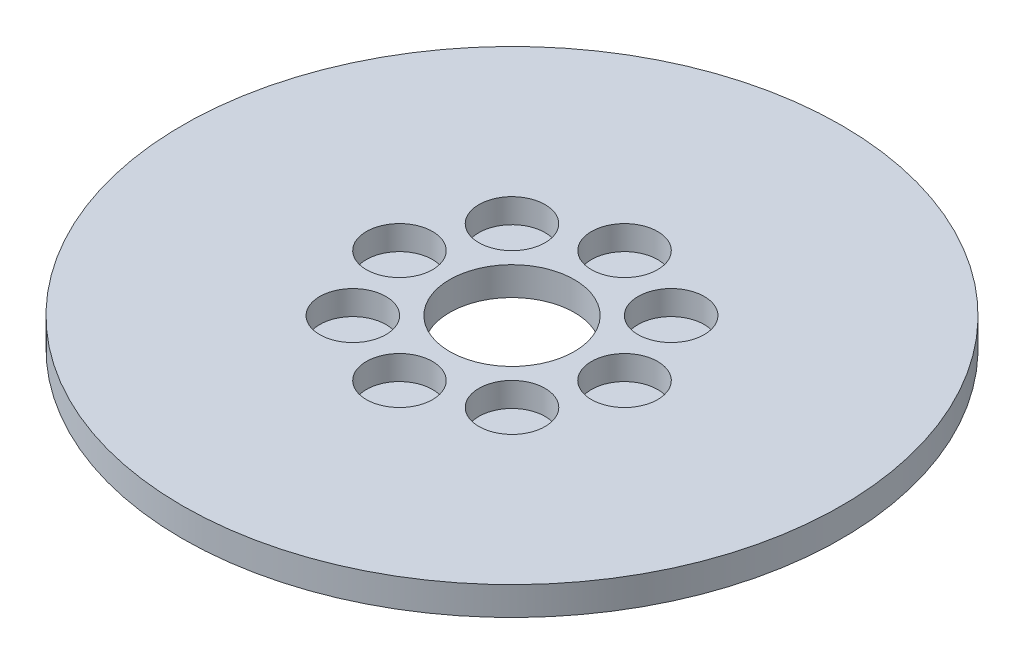
ISO-10303-21;
HEADER;
FILE_DESCRIPTION(('STEP AP214'),'2;1');
FILE_NAME('part.step','',(''),(''),'','','');
FILE_SCHEMA(('AUTOMOTIVE_DESIGN { 1 0 10303 214 1 1 1 1 }'));
ENDSEC;
DATA;
#1=APPLICATION_CONTEXT('core data for automotive mechanical design processes');
#2=APPLICATION_PROTOCOL_DEFINITION('international standard','automotive_design',2000,#1);
#3=PRODUCT_CONTEXT('',#1,'mechanical');
#4=PRODUCT('Part','Part','',(#3));
#5=PRODUCT_RELATED_PRODUCT_CATEGORY('part','',(#4));
#6=PRODUCT_DEFINITION_FORMATION('','',#4);
#7=PRODUCT_DEFINITION_CONTEXT('part definition',#1,'design');
#8=PRODUCT_DEFINITION('design','',#6,#7);
#9=PRODUCT_DEFINITION_SHAPE('','',#8);
#10=(LENGTH_UNIT() NAMED_UNIT(*) SI_UNIT(.MILLI.,.METRE.));
#11=(NAMED_UNIT(*) PLANE_ANGLE_UNIT() SI_UNIT($,.RADIAN.));
#12=(NAMED_UNIT(*) SI_UNIT($,.STERADIAN.) SOLID_ANGLE_UNIT());
#13=UNCERTAINTY_MEASURE_WITH_UNIT(LENGTH_MEASURE(1.E-05),#10,'distance_accuracy_value','');
#14=(GEOMETRIC_REPRESENTATION_CONTEXT(3) GLOBAL_UNCERTAINTY_ASSIGNED_CONTEXT((#13)) GLOBAL_UNIT_ASSIGNED_CONTEXT((#10,
#11,#12)) REPRESENTATION_CONTEXT('',''));
#15=CARTESIAN_POINT('',(0.,0.,0.));
#16=DIRECTION('',(0.,0.,1.));
#17=DIRECTION('',(1.,0.,0.));
#18=AXIS2_PLACEMENT_3D('',#15,#16,#17);
#19=CARTESIAN_POINT('',(0.,8.,0.));
#20=DIRECTION('',(0.,-1.,0.));
#21=DIRECTION('',(0.,0.,-1.));
#22=AXIS2_PLACEMENT_3D('',#19,#20,#21);
#23=CYLINDRICAL_SURFACE('',#22,92.5);
#24=CARTESIAN_POINT('',(0.,8.,0.));
#25=DIRECTION('',(0.,1.,0.));
#26=DIRECTION('',(0.,0.,1.));
#27=AXIS2_PLACEMENT_3D('',#24,#25,#26);
#28=CIRCLE('',#27,92.5);
#29=CARTESIAN_POINT('',(0.,8.,92.5));
#30=VERTEX_POINT('',#29);
#31=EDGE_CURVE('E10',#30,#30,#28,.T.);
#32=ORIENTED_EDGE('',*,*,#31,.F.);
#33=EDGE_LOOP('',(#32));
#34=FACE_BOUND('',#33,.T.);
#35=CARTESIAN_POINT('',(0.,0.,0.));
#36=DIRECTION('',(0.,1.,0.));
#37=DIRECTION('',(0.,0.,1.));
#38=AXIS2_PLACEMENT_3D('',#35,#36,#37);
#39=CIRCLE('',#38,92.5);
#40=CARTESIAN_POINT('',(0.,0.,92.5));
#41=VERTEX_POINT('',#40);
#42=EDGE_CURVE('E37',#41,#41,#39,.T.);
#43=ORIENTED_EDGE('',*,*,#42,.T.);
#44=EDGE_LOOP('',(#43));
#45=FACE_BOUND('',#44,.T.);
#46=ADVANCED_FACE('F40',(#34,#45),#23,.T.);
#47=CARTESIAN_POINT('',(0.,8.,0.));
#48=DIRECTION('',(0.,1.,0.));
#49=DIRECTION('',(0.,0.,1.));
#50=AXIS2_PLACEMENT_3D('',#47,#48,#49);
#51=PLANE('',#50);
#52=CARTESIAN_POINT('',(1.10284283422224E-13,8.,31.586674170444));
#53=DIRECTION('',(0.,1.,0.));
#54=DIRECTION('',(1.,0.,0.));
#55=AXIS2_PLACEMENT_3D('',#52,#53,#54);
#56=CIRCLE('',#55,9.28928895922202);
#57=CARTESIAN_POINT('',(9.28928895922213,8.,31.586674170444));
#58=VERTEX_POINT('',#57);
#59=EDGE_CURVE('E88',#58,#58,#56,.T.);
#60=ORIENTED_EDGE('',*,*,#59,.F.);
#61=EDGE_LOOP('',(#60));
#62=FACE_BOUND('',#61,.T.);
#63=CARTESIAN_POINT('',(22.335151501051,8.,22.3351515010508));
#64=DIRECTION('',(0.,1.,0.));
#65=DIRECTION('',(0.707106781186544,0.,-0.707106781186551));
#66=AXIS2_PLACEMENT_3D('',#63,#64,#65);
#67=CIRCLE('',#66,9.28928895922202);
#68=CARTESIAN_POINT('',(28.9036707165182,8.,15.7666322855836));
#69=VERTEX_POINT('',#68);
#70=EDGE_CURVE('E79',#69,#69,#67,.T.);
#71=ORIENTED_EDGE('',*,*,#70,.F.);
#72=EDGE_LOOP('',(#71));
#73=FACE_BOUND('',#72,.T.);
#74=CARTESIAN_POINT('',(31.586674170444,8.,0.));
#75=DIRECTION('',(0.,1.,0.));
#76=DIRECTION('',(0.,0.,-1.));
#77=AXIS2_PLACEMENT_3D('',#74,#75,#76);
#78=CIRCLE('',#77,9.28928895922202);
#79=CARTESIAN_POINT('',(31.586674170444,8.,-9.28928895922202));
#80=VERTEX_POINT('',#79);
#81=EDGE_CURVE('E74',#80,#80,#78,.T.);
#82=ORIENTED_EDGE('',*,*,#81,.F.);
#83=EDGE_LOOP('',(#82));
#84=FACE_BOUND('',#83,.T.);
#85=CARTESIAN_POINT('',(22.3351515010507,8.,-22.3351515010511));
#86=DIRECTION('',(0.,1.,0.));
#87=DIRECTION('',(-0.707106781186554,0.,-0.707106781186541));
#88=AXIS2_PLACEMENT_3D('',#85,#86,#87);
#89=CIRCLE('',#88,9.28928895922202);
#90=CARTESIAN_POINT('',(15.7666322855835,8.,-28.9036707165183));
#91=VERTEX_POINT('',#90);
#92=EDGE_CURVE('E70',#91,#91,#89,.T.);
#93=ORIENTED_EDGE('',*,*,#92,.F.);
#94=EDGE_LOOP('',(#93));
#95=FACE_BOUND('',#94,.T.);
#96=CARTESIAN_POINT('',(-3.30852850266671E-13,8.,-31.586674170444));
#97=DIRECTION('',(0.,1.,0.));
#98=DIRECTION('',(-1.,0.,0.));
#99=AXIS2_PLACEMENT_3D('',#96,#97,#98);
#100=CIRCLE('',#99,9.28928895922202);
#101=CARTESIAN_POINT('',(-9.28928895922235,8.,-31.5866741704439));
#102=VERTEX_POINT('',#101);
#103=EDGE_CURVE('E100',#102,#102,#100,.T.);
#104=ORIENTED_EDGE('',*,*,#103,.F.);
#105=EDGE_LOOP('',(#104));
#106=FACE_BOUND('',#105,.T.);
#107=CARTESIAN_POINT('',(-22.3351515010512,8.,-22.3351515010507));
#108=DIRECTION('',(0.,1.,0.));
#109=DIRECTION('',(-0.707106781186539,0.,0.707106781186556));
#110=AXIS2_PLACEMENT_3D('',#107,#108,#109);
#111=CIRCLE('',#110,9.28928895922202);
#112=CARTESIAN_POINT('',(-28.9036707165183,8.,-15.7666322855834));
#113=VERTEX_POINT('',#112);
#114=EDGE_CURVE('E93',#113,#113,#111,.T.);
#115=ORIENTED_EDGE('',*,*,#114,.F.);
#116=EDGE_LOOP('',(#115));
#117=FACE_BOUND('',#116,.T.);
#118=CARTESIAN_POINT('',(-22.3351515010509,8.,22.335151501051));
#119=DIRECTION('',(0.,1.,0.));
#120=DIRECTION('',(0.707106781186549,0.,0.707106781186546));
#121=AXIS2_PLACEMENT_3D('',#118,#119,#120);
#122=CIRCLE('',#121,9.28928895922202);
#123=CARTESIAN_POINT('',(-15.7666322855837,8.,28.9036707165182));
#124=VERTEX_POINT('',#123);
#125=EDGE_CURVE('E61',#124,#124,#122,.T.);
#126=ORIENTED_EDGE('',*,*,#125,.F.);
#127=EDGE_LOOP('',(#126));
#128=FACE_BOUND('',#127,.T.);
#129=CARTESIAN_POINT('',(-31.586674170444,8.,0.));
#130=DIRECTION('',(0.,1.,0.));
#131=DIRECTION('',(0.,0.,1.));
#132=AXIS2_PLACEMENT_3D('',#129,#130,#131);
#133=CIRCLE('',#132,9.28928895922202);
#134=CARTESIAN_POINT('',(-31.586674170444,8.,9.28928895922202));
#135=VERTEX_POINT('',#134);
#136=EDGE_CURVE('E54',#135,#135,#133,.T.);
#137=ORIENTED_EDGE('',*,*,#136,.F.);
#138=EDGE_LOOP('',(#137));
#139=FACE_BOUND('',#138,.T.);
#140=CARTESIAN_POINT('',(0.,8.,0.));
#141=DIRECTION('',(0.,1.,0.));
#142=DIRECTION('',(0.,0.,1.));
#143=AXIS2_PLACEMENT_3D('',#140,#141,#142);
#144=CIRCLE('',#143,17.5);
#145=CARTESIAN_POINT('',(0.,8.,17.5));
#146=VERTEX_POINT('',#145);
#147=EDGE_CURVE('E50',#146,#146,#144,.T.);
#148=ORIENTED_EDGE('',*,*,#147,.F.);
#149=EDGE_LOOP('',(#148));
#150=FACE_BOUND('',#149,.T.);
#151=ORIENTED_EDGE('',*,*,#31,.T.);
#152=EDGE_LOOP('',(#151));
#153=FACE_BOUND('',#152,.T.);
#154=ADVANCED_FACE('F115',(#62,#73,#84,#95,#106,#117,#128,#139,#150,#153),#51,.T.);
#155=CARTESIAN_POINT('',(0.,0.,0.));
#156=DIRECTION('',(0.,1.,0.));
#157=DIRECTION('',(0.,0.,1.));
#158=AXIS2_PLACEMENT_3D('',#155,#156,#157);
#159=PLANE('',#158);
#160=CARTESIAN_POINT('',(0.,0.,0.));
#161=DIRECTION('',(0.,1.,0.));
#162=DIRECTION('',(0.,0.,1.));
#163=AXIS2_PLACEMENT_3D('',#160,#161,#162);
#164=CIRCLE('',#163,17.5);
#165=CARTESIAN_POINT('',(0.,0.,17.5));
#166=VERTEX_POINT('',#165);
#167=EDGE_CURVE('E47',#166,#166,#164,.T.);
#168=ORIENTED_EDGE('',*,*,#167,.T.);
#169=EDGE_LOOP('',(#168));
#170=FACE_BOUND('',#169,.T.);
#171=ORIENTED_EDGE('',*,*,#42,.F.);
#172=EDGE_LOOP('',(#171));
#173=FACE_BOUND('',#172,.T.);
#174=ADVANCED_FACE('F113',(#170,#173),#159,.F.);
#175=CARTESIAN_POINT('',(0.,8.,0.));
#176=DIRECTION('',(0.,-1.,0.));
#177=DIRECTION('',(0.,0.,-1.));
#178=AXIS2_PLACEMENT_3D('',#175,#176,#177);
#179=CYLINDRICAL_SURFACE('',#178,17.5);
#180=ORIENTED_EDGE('',*,*,#147,.T.);
#181=EDGE_LOOP('',(#180));
#182=FACE_BOUND('',#181,.T.);
#183=ORIENTED_EDGE('',*,*,#167,.F.);
#184=EDGE_LOOP('',(#183));
#185=FACE_BOUND('',#184,.T.);
#186=ADVANCED_FACE('F127',(#182,#185),#179,.F.);
#187=CARTESIAN_POINT('',(-31.586674170444,1.17657465871776,0.));
#188=DIRECTION('',(0.,1.,0.));
#189=DIRECTION('',(0.,0.,1.));
#190=AXIS2_PLACEMENT_3D('',#187,#188,#189);
#191=CYLINDRICAL_SURFACE('',#190,9.28928895922202);
#192=CARTESIAN_POINT('',(-31.586674170444,1.17657465871776,0.));
#193=DIRECTION('',(0.,1.,0.));
#194=DIRECTION('',(0.,0.,1.));
#195=AXIS2_PLACEMENT_3D('',#192,#193,#194);
#196=CIRCLE('',#195,9.28928895922202);
#197=CARTESIAN_POINT('',(-31.586674170444,1.17657465871776,9.28928895922202));
#198=VERTEX_POINT('',#197);
#199=EDGE_CURVE('E55',#198,#198,#196,.T.);
#200=ORIENTED_EDGE('',*,*,#199,.F.);
#201=EDGE_LOOP('',(#200));
#202=FACE_BOUND('',#201,.T.);
#203=ORIENTED_EDGE('',*,*,#136,.T.);
#204=EDGE_LOOP('',(#203));
#205=FACE_BOUND('',#204,.T.);
#206=ADVANCED_FACE('F129',(#202,#205),#191,.F.);
#207=CARTESIAN_POINT('',(-31.586674170444,1.17657465871776,0.));
#208=DIRECTION('',(0.,1.,0.));
#209=DIRECTION('',(0.,0.,1.));
#210=AXIS2_PLACEMENT_3D('',#207,#208,#209);
#211=PLANE('',#210);
#212=ORIENTED_EDGE('',*,*,#199,.T.);
#213=EDGE_LOOP('',(#212));
#214=FACE_BOUND('',#213,.T.);
#215=ADVANCED_FACE('F157',(#214),#211,.T.);
#216=CARTESIAN_POINT('',(-22.3351515010509,1.17657465871776,22.335151501051));
#217=DIRECTION('',(0.,1.,0.));
#218=DIRECTION('',(0.,0.,1.));
#219=AXIS2_PLACEMENT_3D('',#216,#217,#218);
#220=CYLINDRICAL_SURFACE('',#219,9.28928895922202);
#221=CARTESIAN_POINT('',(-22.3351515010509,1.17657465871776,22.335151501051));
#222=DIRECTION('',(0.,1.,0.));
#223=DIRECTION('',(0.707106781186549,0.,0.707106781186546));
#224=AXIS2_PLACEMENT_3D('',#221,#222,#223);
#225=CIRCLE('',#224,9.28928895922202);
#226=CARTESIAN_POINT('',(-15.7666322855837,1.17657465871776,28.9036707165182));
#227=VERTEX_POINT('',#226);
#228=EDGE_CURVE('E59',#227,#227,#225,.T.);
#229=ORIENTED_EDGE('',*,*,#228,.F.);
#230=EDGE_LOOP('',(#229));
#231=FACE_BOUND('',#230,.T.);
#232=ORIENTED_EDGE('',*,*,#125,.T.);
#233=EDGE_LOOP('',(#232));
#234=FACE_BOUND('',#233,.T.);
#235=ADVANCED_FACE('F170',(#231,#234),#220,.F.);
#236=CARTESIAN_POINT('',(-22.3351515010509,1.17657465871776,22.335151501051));
#237=DIRECTION('',(0.,1.,0.));
#238=DIRECTION('',(0.707106781186549,0.,0.707106781186546));
#239=AXIS2_PLACEMENT_3D('',#236,#237,#238);
#240=PLANE('',#239);
#241=ORIENTED_EDGE('',*,*,#228,.T.);
#242=EDGE_LOOP('',(#241));
#243=FACE_BOUND('',#242,.T.);
#244=ADVANCED_FACE('F182',(#243),#240,.T.);
#245=CARTESIAN_POINT('',(-22.3351515010512,1.17657465871776,-22.3351515010507));
#246=DIRECTION('',(0.,1.,0.));
#247=DIRECTION('',(0.,0.,1.));
#248=AXIS2_PLACEMENT_3D('',#245,#246,#247);
#249=CYLINDRICAL_SURFACE('',#248,9.28928895922202);
#250=CARTESIAN_POINT('',(-22.3351515010512,1.17657465871776,-22.3351515010507));
#251=DIRECTION('',(0.,1.,0.));
#252=DIRECTION('',(-0.707106781186539,0.,0.707106781186556));
#253=AXIS2_PLACEMENT_3D('',#250,#251,#252);
#254=CIRCLE('',#253,9.28928895922202);
#255=CARTESIAN_POINT('',(-28.9036707165183,1.17657465871776,-15.7666322855834));
#256=VERTEX_POINT('',#255);
#257=EDGE_CURVE('E94',#256,#256,#254,.T.);
#258=ORIENTED_EDGE('',*,*,#257,.F.);
#259=EDGE_LOOP('',(#258));
#260=FACE_BOUND('',#259,.T.);
#261=ORIENTED_EDGE('',*,*,#114,.T.);
#262=EDGE_LOOP('',(#261));
#263=FACE_BOUND('',#262,.T.);
#264=ADVANCED_FACE('F189',(#260,#263),#249,.F.);
#265=CARTESIAN_POINT('',(-22.3351515010512,1.17657465871776,-22.3351515010507));
#266=DIRECTION('',(0.,1.,0.));
#267=DIRECTION('',(-0.707106781186539,0.,0.707106781186556));
#268=AXIS2_PLACEMENT_3D('',#265,#266,#267);
#269=PLANE('',#268);
#270=ORIENTED_EDGE('',*,*,#257,.T.);
#271=EDGE_LOOP('',(#270));
#272=FACE_BOUND('',#271,.T.);
#273=ADVANCED_FACE('F107',(#272),#269,.T.);
#274=CARTESIAN_POINT('',(-3.30852850266671E-13,1.17657465871776,-31.586674170444));
#275=DIRECTION('',(0.,1.,0.));
#276=DIRECTION('',(0.,0.,1.));
#277=AXIS2_PLACEMENT_3D('',#274,#275,#276);
#278=CYLINDRICAL_SURFACE('',#277,9.28928895922202);
#279=CARTESIAN_POINT('',(-3.30852850266671E-13,1.17657465871776,-31.586674170444));
#280=DIRECTION('',(0.,1.,0.));
#281=DIRECTION('',(-1.,0.,0.));
#282=AXIS2_PLACEMENT_3D('',#279,#280,#281);
#283=CIRCLE('',#282,9.28928895922202);
#284=CARTESIAN_POINT('',(-9.28928895922235,1.17657465871776,-31.5866741704439));
#285=VERTEX_POINT('',#284);
#286=EDGE_CURVE('E72',#285,#285,#283,.T.);
#287=ORIENTED_EDGE('',*,*,#286,.F.);
#288=EDGE_LOOP('',(#287));
#289=FACE_BOUND('',#288,.T.);
#290=ORIENTED_EDGE('',*,*,#103,.T.);
#291=EDGE_LOOP('',(#290));
#292=FACE_BOUND('',#291,.T.);
#293=ADVANCED_FACE('F104',(#289,#292),#278,.F.);
#294=CARTESIAN_POINT('',(-3.30852850266671E-13,1.17657465871776,-31.586674170444));
#295=DIRECTION('',(0.,1.,0.));
#296=DIRECTION('',(-1.,0.,0.));
#297=AXIS2_PLACEMENT_3D('',#294,#295,#296);
#298=PLANE('',#297);
#299=ORIENTED_EDGE('',*,*,#286,.T.);
#300=EDGE_LOOP('',(#299));
#301=FACE_BOUND('',#300,.T.);
#302=ADVANCED_FACE('F103',(#301),#298,.T.);
#303=CARTESIAN_POINT('',(22.3351515010507,1.17657465871776,-22.3351515010511));
#304=DIRECTION('',(0.,1.,0.));
#305=DIRECTION('',(0.,0.,1.));
#306=AXIS2_PLACEMENT_3D('',#303,#304,#305);
#307=CYLINDRICAL_SURFACE('',#306,9.28928895922202);
#308=CARTESIAN_POINT('',(22.3351515010507,1.17657465871776,-22.3351515010511));
#309=DIRECTION('',(0.,1.,0.));
#310=DIRECTION('',(-0.707106781186554,0.,-0.707106781186541));
#311=AXIS2_PLACEMENT_3D('',#308,#309,#310);
#312=CIRCLE('',#311,9.28928895922202);
#313=CARTESIAN_POINT('',(15.7666322855835,1.17657465871776,-28.9036707165183));
#314=VERTEX_POINT('',#313);
#315=EDGE_CURVE('E69',#314,#314,#312,.T.);
#316=ORIENTED_EDGE('',*,*,#315,.F.);
#317=EDGE_LOOP('',(#316));
#318=FACE_BOUND('',#317,.T.);
#319=ORIENTED_EDGE('',*,*,#92,.T.);
#320=EDGE_LOOP('',(#319));
#321=FACE_BOUND('',#320,.T.);
#322=ADVANCED_FACE('F219',(#318,#321),#307,.F.);
#323=CARTESIAN_POINT('',(22.3351515010507,1.17657465871776,-22.3351515010511));
#324=DIRECTION('',(0.,1.,0.));
#325=DIRECTION('',(-0.707106781186554,0.,-0.707106781186541));
#326=AXIS2_PLACEMENT_3D('',#323,#324,#325);
#327=PLANE('',#326);
#328=ORIENTED_EDGE('',*,*,#315,.T.);
#329=EDGE_LOOP('',(#328));
#330=FACE_BOUND('',#329,.T.);
#331=ADVANCED_FACE('F227',(#330),#327,.T.);
#332=CARTESIAN_POINT('',(31.586674170444,1.17657465871776,0.));
#333=DIRECTION('',(0.,1.,0.));
#334=DIRECTION('',(0.,0.,1.));
#335=AXIS2_PLACEMENT_3D('',#332,#333,#334);
#336=CYLINDRICAL_SURFACE('',#335,9.28928895922202);
#337=CARTESIAN_POINT('',(31.586674170444,1.17657465871776,0.));
#338=DIRECTION('',(0.,1.,0.));
#339=DIRECTION('',(0.,0.,-1.));
#340=AXIS2_PLACEMENT_3D('',#337,#338,#339);
#341=CIRCLE('',#340,9.28928895922202);
#342=CARTESIAN_POINT('',(31.586674170444,1.17657465871776,-9.28928895922202));
#343=VERTEX_POINT('',#342);
#344=EDGE_CURVE('E80',#343,#343,#341,.T.);
#345=ORIENTED_EDGE('',*,*,#344,.F.);
#346=EDGE_LOOP('',(#345));
#347=FACE_BOUND('',#346,.T.);
#348=ORIENTED_EDGE('',*,*,#81,.T.);
#349=EDGE_LOOP('',(#348));
#350=FACE_BOUND('',#349,.T.);
#351=ADVANCED_FACE('F240',(#347,#350),#336,.F.);
#352=CARTESIAN_POINT('',(31.586674170444,1.17657465871776,0.));
#353=DIRECTION('',(0.,1.,0.));
#354=DIRECTION('',(0.,0.,-1.));
#355=AXIS2_PLACEMENT_3D('',#352,#353,#354);
#356=PLANE('',#355);
#357=ORIENTED_EDGE('',*,*,#344,.T.);
#358=EDGE_LOOP('',(#357));
#359=FACE_BOUND('',#358,.T.);
#360=ADVANCED_FACE('F246',(#359),#356,.T.);
#361=CARTESIAN_POINT('',(22.335151501051,1.17657465871776,22.3351515010508));
#362=DIRECTION('',(0.,1.,0.));
#363=DIRECTION('',(0.,0.,1.));
#364=AXIS2_PLACEMENT_3D('',#361,#362,#363);
#365=CYLINDRICAL_SURFACE('',#364,9.28928895922202);
#366=CARTESIAN_POINT('',(22.335151501051,1.17657465871776,22.3351515010508));
#367=DIRECTION('',(0.,1.,0.));
#368=DIRECTION('',(0.707106781186544,0.,-0.707106781186551));
#369=AXIS2_PLACEMENT_3D('',#366,#367,#368);
#370=CIRCLE('',#369,9.28928895922202);
#371=CARTESIAN_POINT('',(28.9036707165182,1.17657465871776,15.7666322855836));
#372=VERTEX_POINT('',#371);
#373=EDGE_CURVE('E82',#372,#372,#370,.T.);
#374=ORIENTED_EDGE('',*,*,#373,.F.);
#375=EDGE_LOOP('',(#374));
#376=FACE_BOUND('',#375,.T.);
#377=ORIENTED_EDGE('',*,*,#70,.T.);
#378=EDGE_LOOP('',(#377));
#379=FACE_BOUND('',#378,.T.);
#380=ADVANCED_FACE('F254',(#376,#379),#365,.F.);
#381=CARTESIAN_POINT('',(22.335151501051,1.17657465871776,22.3351515010508));
#382=DIRECTION('',(0.,1.,0.));
#383=DIRECTION('',(0.707106781186544,0.,-0.707106781186551));
#384=AXIS2_PLACEMENT_3D('',#381,#382,#383);
#385=PLANE('',#384);
#386=ORIENTED_EDGE('',*,*,#373,.T.);
#387=EDGE_LOOP('',(#386));
#388=FACE_BOUND('',#387,.T.);
#389=ADVANCED_FACE('F262',(#388),#385,.T.);
#390=CARTESIAN_POINT('',(1.10284283422224E-13,1.17657465871776,31.586674170444));
#391=DIRECTION('',(0.,1.,0.));
#392=DIRECTION('',(0.,0.,1.));
#393=AXIS2_PLACEMENT_3D('',#390,#391,#392);
#394=CYLINDRICAL_SURFACE('',#393,9.28928895922202);
#395=CARTESIAN_POINT('',(1.10284283422224E-13,1.17657465871776,31.586674170444));
#396=DIRECTION('',(0.,1.,0.));
#397=DIRECTION('',(1.,0.,0.));
#398=AXIS2_PLACEMENT_3D('',#395,#396,#397);
#399=CIRCLE('',#398,9.28928895922202);
#400=CARTESIAN_POINT('',(9.28928895922213,1.17657465871776,31.586674170444));
#401=VERTEX_POINT('',#400);
#402=EDGE_CURVE('E63',#401,#401,#399,.T.);
#403=ORIENTED_EDGE('',*,*,#402,.F.);
#404=EDGE_LOOP('',(#403));
#405=FACE_BOUND('',#404,.T.);
#406=ORIENTED_EDGE('',*,*,#59,.T.);
#407=EDGE_LOOP('',(#406));
#408=FACE_BOUND('',#407,.T.);
#409=ADVANCED_FACE('F272',(#405,#408),#394,.F.);
#410=CARTESIAN_POINT('',(1.10284283422224E-13,1.17657465871776,31.586674170444));
#411=DIRECTION('',(0.,1.,0.));
#412=DIRECTION('',(1.,0.,0.));
#413=AXIS2_PLACEMENT_3D('',#410,#411,#412);
#414=PLANE('',#413);
#415=ORIENTED_EDGE('',*,*,#402,.T.);
#416=EDGE_LOOP('',(#415));
#417=FACE_BOUND('',#416,.T.);
#418=ADVANCED_FACE('F285',(#417),#414,.T.);
#419=CLOSED_SHELL('',(#46,#154,#174,#186,#206,#215,#235,#244,#264,#273,#293,#302,#322,#331,#351,
#360,#380,#389,#409,#418));
#420=MANIFOLD_SOLID_BREP('B2',#419);
#421=ADVANCED_BREP_SHAPE_REPRESENTATION('',(#18,#420),#14);
#422=SHAPE_DEFINITION_REPRESENTATION(#9,#421);
ENDSEC;
END-ISO-10303-21;
